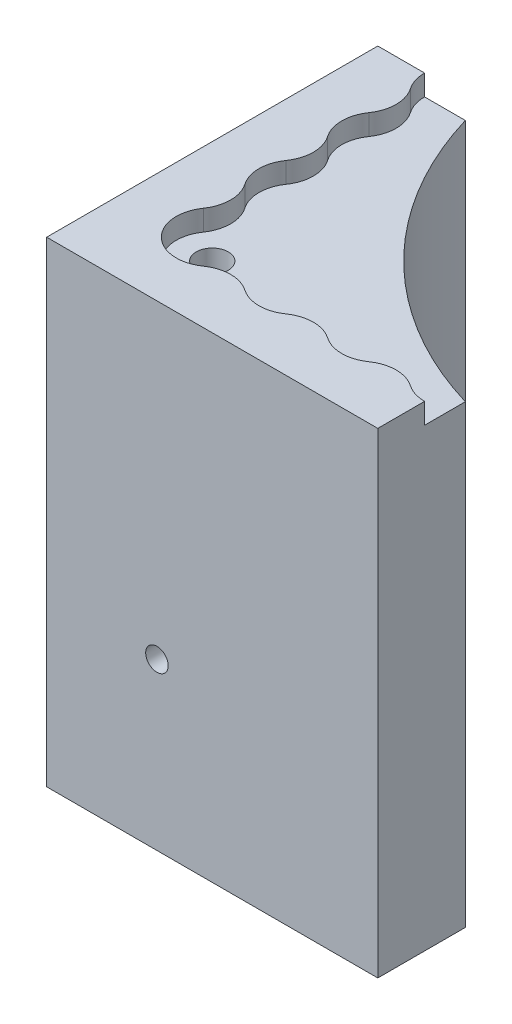
ISO-10303-21;
HEADER;
FILE_DESCRIPTION(('STEP AP214'),'2;1');
FILE_NAME('part.step','',(''),(''),'','','');
FILE_SCHEMA(('AUTOMOTIVE_DESIGN { 1 0 10303 214 1 1 1 1 }'));
ENDSEC;
DATA;
#1=APPLICATION_CONTEXT('core data for automotive mechanical design processes');
#2=APPLICATION_PROTOCOL_DEFINITION('international standard','automotive_design',2000,#1);
#3=PRODUCT_CONTEXT('',#1,'mechanical');
#4=PRODUCT('Part','Part','',(#3));
#5=PRODUCT_RELATED_PRODUCT_CATEGORY('part','',(#4));
#6=PRODUCT_DEFINITION_FORMATION('','',#4);
#7=PRODUCT_DEFINITION_CONTEXT('part definition',#1,'design');
#8=PRODUCT_DEFINITION('design','',#6,#7);
#9=PRODUCT_DEFINITION_SHAPE('','',#8);
#10=(LENGTH_UNIT() NAMED_UNIT(*) SI_UNIT(.MILLI.,.METRE.));
#11=(NAMED_UNIT(*) PLANE_ANGLE_UNIT() SI_UNIT($,.RADIAN.));
#12=(NAMED_UNIT(*) SI_UNIT($,.STERADIAN.) SOLID_ANGLE_UNIT());
#13=UNCERTAINTY_MEASURE_WITH_UNIT(LENGTH_MEASURE(1.E-05),#10,'distance_accuracy_value','');
#14=(GEOMETRIC_REPRESENTATION_CONTEXT(3) GLOBAL_UNCERTAINTY_ASSIGNED_CONTEXT((#13)) GLOBAL_UNIT_ASSIGNED_CONTEXT((#10,
#11,#12)) REPRESENTATION_CONTEXT('',''));
#15=CARTESIAN_POINT('',(0.,0.,0.));
#16=DIRECTION('',(0.,0.,1.));
#17=DIRECTION('',(1.,0.,0.));
#18=AXIS2_PLACEMENT_3D('',#15,#16,#17);
#19=CARTESIAN_POINT('',(0.,73.025,0.));
#20=DIRECTION('',(1.,0.,0.));
#21=DIRECTION('',(0.,0.,-1.));
#22=AXIS2_PLACEMENT_3D('',#19,#20,#21);
#23=PLANE('',#22);
#24=CARTESIAN_POINT('',(0.,25.3999999999999,-18.7319999999885));
#25=DIRECTION('',(-1.,0.,0.));
#26=DIRECTION('',(0.,0.,1.));
#27=AXIS2_PLACEMENT_3D('',#24,#25,#26);
#28=CIRCLE('',#27,1.7272);
#29=CARTESIAN_POINT('',(0.,25.3999999999999,-17.0047999999885));
#30=VERTEX_POINT('',#29);
#31=EDGE_CURVE('E223',#30,#30,#28,.T.);
#32=ORIENTED_EDGE('',*,*,#31,.F.);
#33=EDGE_LOOP('',(#32));
#34=FACE_BOUND('',#33,.T.);
#35=DIRECTION('',(0.,0.,1.));
#36=VECTOR('',#35,1.);
#37=CARTESIAN_POINT('',(0.,0.,0.));
#38=LINE('',#37,#36);
#39=CARTESIAN_POINT('',(0.,0.,-50.8));
#40=VERTEX_POINT('',#39);
#41=CARTESIAN_POINT('',(0.,0.,0.));
#42=VERTEX_POINT('',#41);
#43=EDGE_CURVE('E389',#40,#42,#38,.T.);
#44=ORIENTED_EDGE('',*,*,#43,.T.);
#45=DIRECTION('',(0.,-1.,0.));
#46=VECTOR('',#45,1.);
#47=CARTESIAN_POINT('',(0.,73.025,0.));
#48=LINE('',#47,#46);
#49=CARTESIAN_POINT('',(0.,73.025,0.));
#50=VERTEX_POINT('',#49);
#51=EDGE_CURVE('E424',#50,#42,#48,.T.);
#52=ORIENTED_EDGE('',*,*,#51,.F.);
#53=DIRECTION('',(0.,0.,1.));
#54=VECTOR('',#53,1.);
#55=CARTESIAN_POINT('',(0.,73.025,0.));
#56=LINE('',#55,#54);
#57=CARTESIAN_POINT('',(0.,73.025,-50.8));
#58=VERTEX_POINT('',#57);
#59=EDGE_CURVE('E390',#58,#50,#56,.T.);
#60=ORIENTED_EDGE('',*,*,#59,.F.);
#61=DIRECTION('',(0.,-1.,0.));
#62=VECTOR('',#61,1.);
#63=CARTESIAN_POINT('',(0.,73.025,-50.8));
#64=LINE('',#63,#62);
#65=EDGE_CURVE('E404',#58,#40,#64,.T.);
#66=ORIENTED_EDGE('',*,*,#65,.T.);
#67=EDGE_LOOP('',(#44,#52,#60,#66));
#68=FACE_BOUND('',#67,.T.);
#69=ADVANCED_FACE('F47',(#34,#68),#23,.F.);
#70=CARTESIAN_POINT('',(0.,73.025,0.));
#71=DIRECTION('',(0.,0.,-1.));
#72=DIRECTION('',(-1.,0.,0.));
#73=AXIS2_PLACEMENT_3D('',#70,#71,#72);
#74=PLANE('',#73);
#75=CARTESIAN_POINT('',(16.9179999999882,25.3999999999999,-1.10986530529513E-13));
#76=DIRECTION('',(0.,0.,1.));
#77=DIRECTION('',(1.,0.,0.));
#78=AXIS2_PLACEMENT_3D('',#75,#76,#77);
#79=CIRCLE('',#78,1.7272);
#80=CARTESIAN_POINT('',(18.6451999999882,25.3999999999999,-1.10986530529513E-13));
#81=VERTEX_POINT('',#80);
#82=EDGE_CURVE('E222',#81,#81,#79,.T.);
#83=ORIENTED_EDGE('',*,*,#82,.F.);
#84=EDGE_LOOP('',(#83));
#85=FACE_BOUND('',#84,.T.);
#86=DIRECTION('',(1.,0.,0.));
#87=VECTOR('',#86,1.);
#88=CARTESIAN_POINT('',(0.,0.,0.));
#89=LINE('',#88,#87);
#90=CARTESIAN_POINT('',(50.8,0.,0.));
#91=VERTEX_POINT('',#90);
#92=EDGE_CURVE('E408',#42,#91,#89,.T.);
#93=ORIENTED_EDGE('',*,*,#92,.T.);
#94=DIRECTION('',(0.,-1.,0.));
#95=VECTOR('',#94,1.);
#96=CARTESIAN_POINT('',(50.8,73.025,0.));
#97=LINE('',#96,#95);
#98=CARTESIAN_POINT('',(50.8,73.025,0.));
#99=VERTEX_POINT('',#98);
#100=EDGE_CURVE('E420',#99,#91,#97,.T.);
#101=ORIENTED_EDGE('',*,*,#100,.F.);
#102=DIRECTION('',(1.,0.,0.));
#103=VECTOR('',#102,1.);
#104=CARTESIAN_POINT('',(0.,73.025,0.));
#105=LINE('',#104,#103);
#106=EDGE_CURVE('E394',#50,#99,#105,.T.);
#107=ORIENTED_EDGE('',*,*,#106,.F.);
#108=ORIENTED_EDGE('',*,*,#51,.T.);
#109=EDGE_LOOP('',(#93,#101,#107,#108));
#110=FACE_BOUND('',#109,.T.);
#111=ADVANCED_FACE('F496',(#85,#110),#74,.F.);
#112=CARTESIAN_POINT('',(50.8,73.025,0.));
#113=DIRECTION('',(-1.,0.,0.));
#114=DIRECTION('',(0.,0.,1.));
#115=AXIS2_PLACEMENT_3D('',#112,#113,#114);
#116=PLANE('',#115);
#117=DIRECTION('',(0.,0.,-1.));
#118=VECTOR('',#117,1.);
#119=CARTESIAN_POINT('',(50.8,0.,0.));
#120=LINE('',#119,#118);
#121=CARTESIAN_POINT('',(50.8,0.,-13.4286312857863));
#122=VERTEX_POINT('',#121);
#123=EDGE_CURVE('E411',#91,#122,#120,.T.);
#124=ORIENTED_EDGE('',*,*,#123,.T.);
#125=DIRECTION('',(0.,1.,0.));
#126=VECTOR('',#125,1.);
#127=CARTESIAN_POINT('',(50.8,0.,-13.4286312857863));
#128=LINE('',#127,#126);
#129=CARTESIAN_POINT('',(50.8,69.85,-13.4286312857863));
#130=VERTEX_POINT('',#129);
#131=EDGE_CURVE('E246',#122,#130,#128,.T.);
#132=ORIENTED_EDGE('',*,*,#131,.T.);
#133=DIRECTION('',(0.,0.,-1.));
#134=VECTOR('',#133,1.);
#135=CARTESIAN_POINT('',(50.8,69.85,0.));
#136=LINE('',#135,#134);
#137=CARTESIAN_POINT('',(50.8,69.85,-7.17550000000003));
#138=VERTEX_POINT('',#137);
#139=EDGE_CURVE('E386',#138,#130,#136,.T.);
#140=ORIENTED_EDGE('',*,*,#139,.F.);
#141=DIRECTION('',(0.,1.,0.));
#142=VECTOR('',#141,1.);
#143=CARTESIAN_POINT('',(50.8,69.85,-7.17550000000003));
#144=LINE('',#143,#142);
#145=CARTESIAN_POINT('',(50.8,73.025,-7.17550000000003));
#146=VERTEX_POINT('',#145);
#147=EDGE_CURVE('E383',#138,#146,#144,.T.);
#148=ORIENTED_EDGE('',*,*,#147,.T.);
#149=DIRECTION('',(0.,0.,-1.));
#150=VECTOR('',#149,1.);
#151=CARTESIAN_POINT('',(50.8,73.025,0.));
#152=LINE('',#151,#150);
#153=EDGE_CURVE('E398',#99,#146,#152,.T.);
#154=ORIENTED_EDGE('',*,*,#153,.F.);
#155=ORIENTED_EDGE('',*,*,#100,.T.);
#156=EDGE_LOOP('',(#124,#132,#140,#148,#154,#155));
#157=FACE_BOUND('',#156,.T.);
#158=ADVANCED_FACE('F493',(#157),#116,.F.);
#159=CARTESIAN_POINT('',(0.,73.025,-50.8));
#160=DIRECTION('',(0.,0.,1.));
#161=DIRECTION('',(1.,0.,0.));
#162=AXIS2_PLACEMENT_3D('',#159,#160,#161);
#163=PLANE('',#162);
#164=DIRECTION('',(-1.,0.,0.));
#165=VECTOR('',#164,1.);
#166=CARTESIAN_POINT('',(0.,69.85,-50.8));
#167=LINE('',#166,#165);
#168=CARTESIAN_POINT('',(13.4286312857863,69.85,-50.8));
#169=VERTEX_POINT('',#168);
#170=CARTESIAN_POINT('',(7.17550000000002,69.85,-50.8));
#171=VERTEX_POINT('',#170);
#172=EDGE_CURVE('E55',#169,#171,#167,.T.);
#173=ORIENTED_EDGE('',*,*,#172,.F.);
#174=DIRECTION('',(0.,1.,0.));
#175=VECTOR('',#174,1.);
#176=CARTESIAN_POINT('',(13.4286312857863,0.,-50.8));
#177=LINE('',#176,#175);
#178=CARTESIAN_POINT('',(13.4286312857863,0.,-50.8));
#179=VERTEX_POINT('',#178);
#180=EDGE_CURVE('E64',#169,#179,#177,.F.);
#181=ORIENTED_EDGE('',*,*,#180,.T.);
#182=DIRECTION('',(-1.,0.,0.));
#183=VECTOR('',#182,1.);
#184=CARTESIAN_POINT('',(0.,0.,-50.8));
#185=LINE('',#184,#183);
#186=EDGE_CURVE('E395',#179,#40,#185,.T.);
#187=ORIENTED_EDGE('',*,*,#186,.T.);
#188=ORIENTED_EDGE('',*,*,#65,.F.);
#189=DIRECTION('',(-1.,0.,0.));
#190=VECTOR('',#189,1.);
#191=CARTESIAN_POINT('',(0.,73.025,-50.8));
#192=LINE('',#191,#190);
#193=CARTESIAN_POINT('',(7.17550000000002,73.025,-50.8));
#194=VERTEX_POINT('',#193);
#195=EDGE_CURVE('E401',#194,#58,#192,.T.);
#196=ORIENTED_EDGE('',*,*,#195,.F.);
#197=DIRECTION('',(0.,1.,0.));
#198=VECTOR('',#197,1.);
#199=CARTESIAN_POINT('',(7.17550000000002,69.85,-50.8));
#200=LINE('',#199,#198);
#201=EDGE_CURVE('E75',#194,#171,#200,.F.);
#202=ORIENTED_EDGE('',*,*,#201,.T.);
#203=EDGE_LOOP('',(#173,#181,#187,#188,#196,#202));
#204=FACE_BOUND('',#203,.T.);
#205=ADVANCED_FACE('F437',(#204),#163,.F.);
#206=CARTESIAN_POINT('',(0.,73.025,0.));
#207=DIRECTION('',(0.,-1.,0.));
#208=DIRECTION('',(0.,0.,-1.));
#209=AXIS2_PLACEMENT_3D('',#206,#207,#208);
#210=PLANE('',#209);
#211=ORIENTED_EDGE('',*,*,#153,.T.);
#212=CARTESIAN_POINT('',(50.8,73.025,-12.7));
#213=DIRECTION('',(0.,1.,0.));
#214=DIRECTION('',(0.,0.,1.));
#215=AXIS2_PLACEMENT_3D('',#212,#213,#214);
#216=CIRCLE('',#215,5.5245);
#217=CARTESIAN_POINT('',(47.6431428571429,73.025,-8.16630909417155));
#218=VERTEX_POINT('',#217);
#219=EDGE_CURVE('E255',#218,#146,#216,.T.);
#220=ORIENTED_EDGE('',*,*,#219,.F.);
#221=CARTESIAN_POINT('',(44.45,73.025,-3.58050679862091));
#222=DIRECTION('',(0.,-1.,0.));
#223=DIRECTION('',(0.,0.,1.));
#224=AXIS2_PLACEMENT_3D('',#221,#222,#223);
#225=CIRCLE('',#224,5.588);
#226=CARTESIAN_POINT('',(41.2568571428572,73.025,-8.16630909417154));
#227=VERTEX_POINT('',#226);
#228=EDGE_CURVE('E342',#227,#218,#225,.T.);
#229=ORIENTED_EDGE('',*,*,#228,.F.);
#230=CARTESIAN_POINT('',(38.1,73.025,-12.7));
#231=DIRECTION('',(0.,1.,0.));
#232=DIRECTION('',(0.,0.,1.));
#233=AXIS2_PLACEMENT_3D('',#230,#231,#232);
#234=CIRCLE('',#233,5.5245);
#235=CARTESIAN_POINT('',(34.9431428571429,73.025,-8.16630909417153));
#236=VERTEX_POINT('',#235);
#237=EDGE_CURVE('E338',#236,#227,#234,.T.);
#238=ORIENTED_EDGE('',*,*,#237,.F.);
#239=CARTESIAN_POINT('',(31.75,73.025,-3.58050679862088));
#240=DIRECTION('',(0.,-1.,0.));
#241=DIRECTION('',(0.,0.,1.));
#242=AXIS2_PLACEMENT_3D('',#239,#240,#241);
#243=CIRCLE('',#242,5.588);
#244=CARTESIAN_POINT('',(28.5568571428572,73.025,-8.16630909417152));
#245=VERTEX_POINT('',#244);
#246=EDGE_CURVE('E334',#245,#236,#243,.T.);
#247=ORIENTED_EDGE('',*,*,#246,.F.);
#248=CARTESIAN_POINT('',(25.4,73.025,-12.7));
#249=DIRECTION('',(0.,1.,0.));
#250=DIRECTION('',(0.,0.,1.));
#251=AXIS2_PLACEMENT_3D('',#248,#249,#250);
#252=CIRCLE('',#251,5.5245);
#253=CARTESIAN_POINT('',(22.2431428571429,73.025,-8.16630909417153));
#254=VERTEX_POINT('',#253);
#255=EDGE_CURVE('E330',#254,#245,#252,.T.);
#256=ORIENTED_EDGE('',*,*,#255,.F.);
#257=CARTESIAN_POINT('',(19.05,73.025,-3.58050679862087));
#258=DIRECTION('',(0.,-1.,0.));
#259=DIRECTION('',(0.,0.,1.));
#260=AXIS2_PLACEMENT_3D('',#257,#258,#259);
#261=CIRCLE('',#260,5.588);
#262=CARTESIAN_POINT('',(15.8568571428572,73.025,-8.16630909417152));
#263=VERTEX_POINT('',#262);
#264=EDGE_CURVE('E326',#263,#254,#261,.T.);
#265=ORIENTED_EDGE('',*,*,#264,.F.);
#266=CARTESIAN_POINT('',(12.7,73.025,-12.7));
#267=DIRECTION('',(0.,1.,0.));
#268=DIRECTION('',(0.,0.,1.));
#269=AXIS2_PLACEMENT_3D('',#266,#267,#268);
#270=CIRCLE('',#269,5.5245);
#271=CARTESIAN_POINT('',(8.16630909417153,73.025,-15.8568571428571));
#272=VERTEX_POINT('',#271);
#273=EDGE_CURVE('E322',#272,#263,#270,.T.);
#274=ORIENTED_EDGE('',*,*,#273,.F.);
#275=CARTESIAN_POINT('',(3.58050679862089,73.025,-19.05));
#276=DIRECTION('',(0.,-1.,0.));
#277=DIRECTION('',(0.,0.,1.));
#278=AXIS2_PLACEMENT_3D('',#275,#276,#277);
#279=CIRCLE('',#278,5.588);
#280=CARTESIAN_POINT('',(8.16630909417154,73.025,-22.2431428571428));
#281=VERTEX_POINT('',#280);
#282=EDGE_CURVE('E318',#281,#272,#279,.T.);
#283=ORIENTED_EDGE('',*,*,#282,.F.);
#284=CARTESIAN_POINT('',(12.7,73.025,-25.4));
#285=DIRECTION('',(0.,1.,0.));
#286=DIRECTION('',(0.,0.,1.));
#287=AXIS2_PLACEMENT_3D('',#284,#285,#286);
#288=CIRCLE('',#287,5.5245);
#289=CARTESIAN_POINT('',(8.16630909417154,73.025,-28.5568571428571));
#290=VERTEX_POINT('',#289);
#291=EDGE_CURVE('E314',#290,#281,#288,.T.);
#292=ORIENTED_EDGE('',*,*,#291,.F.);
#293=CARTESIAN_POINT('',(3.5805067986209,73.025,-31.75));
#294=DIRECTION('',(0.,-1.,0.));
#295=DIRECTION('',(0.,0.,1.));
#296=AXIS2_PLACEMENT_3D('',#293,#294,#295);
#297=CIRCLE('',#296,5.588);
#298=CARTESIAN_POINT('',(8.16630909417155,73.025,-34.9431428571428));
#299=VERTEX_POINT('',#298);
#300=EDGE_CURVE('E310',#299,#290,#297,.T.);
#301=ORIENTED_EDGE('',*,*,#300,.F.);
#302=CARTESIAN_POINT('',(12.7,73.025,-38.1));
#303=DIRECTION('',(0.,1.,0.));
#304=DIRECTION('',(0.,0.,1.));
#305=AXIS2_PLACEMENT_3D('',#302,#303,#304);
#306=CIRCLE('',#305,5.5245);
#307=CARTESIAN_POINT('',(8.16630909417156,73.025,-41.2568571428571));
#308=VERTEX_POINT('',#307);
#309=EDGE_CURVE('E306',#308,#299,#306,.T.);
#310=ORIENTED_EDGE('',*,*,#309,.F.);
#311=CARTESIAN_POINT('',(3.58050679862091,73.025,-44.45));
#312=DIRECTION('',(0.,-1.,0.));
#313=DIRECTION('',(0.,0.,1.));
#314=AXIS2_PLACEMENT_3D('',#311,#312,#313);
#315=CIRCLE('',#314,5.588);
#316=CARTESIAN_POINT('',(8.16630909417155,73.025,-47.6431428571429));
#317=VERTEX_POINT('',#316);
#318=EDGE_CURVE('E250',#317,#308,#315,.T.);
#319=ORIENTED_EDGE('',*,*,#318,.F.);
#320=CARTESIAN_POINT('',(12.7,73.025,-50.8));
#321=DIRECTION('',(0.,-1.,0.));
#322=DIRECTION('',(0.,0.,-1.));
#323=AXIS2_PLACEMENT_3D('',#320,#321,#322);
#324=CIRCLE('',#323,5.5245);
#325=EDGE_CURVE('E427',#317,#194,#324,.T.);
#326=ORIENTED_EDGE('',*,*,#325,.T.);
#327=ORIENTED_EDGE('',*,*,#195,.T.);
#328=ORIENTED_EDGE('',*,*,#59,.T.);
#329=ORIENTED_EDGE('',*,*,#106,.T.);
#330=EDGE_LOOP('',(#211,#220,#229,#238,#247,#256,#265,#274,#283,#292,#301,#310,#319,#326,#327,
#328,#329));
#331=FACE_BOUND('',#330,.T.);
#332=ADVANCED_FACE('F441',(#331),#210,.F.);
#333=CARTESIAN_POINT('',(0.,0.,0.));
#334=DIRECTION('',(0.,-1.,0.));
#335=DIRECTION('',(0.,0.,-1.));
#336=AXIS2_PLACEMENT_3D('',#333,#334,#335);
#337=PLANE('',#336);
#338=CARTESIAN_POINT('',(12.7,0.,-12.7));
#339=DIRECTION('',(0.,1.,0.));
#340=DIRECTION('',(0.,0.,1.));
#341=AXIS2_PLACEMENT_3D('',#338,#339,#340);
#342=CIRCLE('',#341,2.45744999999999);
#343=CARTESIAN_POINT('',(12.7,0.,-10.24255));
#344=VERTEX_POINT('',#343);
#345=EDGE_CURVE('E233',#344,#344,#342,.T.);
#346=ORIENTED_EDGE('',*,*,#345,.T.);
#347=EDGE_LOOP('',(#346));
#348=FACE_BOUND('',#347,.T.);
#349=CARTESIAN_POINT('',(66.675,0.,-66.675));
#350=DIRECTION('',(0.,1.,0.));
#351=DIRECTION('',(0.,0.,1.));
#352=AXIS2_PLACEMENT_3D('',#349,#350,#351);
#353=CIRCLE('',#352,55.5625);
#354=EDGE_CURVE('E240',#179,#122,#353,.T.);
#355=ORIENTED_EDGE('',*,*,#354,.T.);
#356=ORIENTED_EDGE('',*,*,#123,.F.);
#357=ORIENTED_EDGE('',*,*,#92,.F.);
#358=ORIENTED_EDGE('',*,*,#43,.F.);
#359=ORIENTED_EDGE('',*,*,#186,.F.);
#360=EDGE_LOOP('',(#355,#356,#357,#358,#359));
#361=FACE_BOUND('',#360,.T.);
#362=ADVANCED_FACE('F499',(#348,#361),#337,.T.);
#363=CARTESIAN_POINT('',(124.51538150761,69.85,-124.51538150761));
#364=DIRECTION('',(0.,1.,0.));
#365=DIRECTION('',(0.,0.,1.));
#366=AXIS2_PLACEMENT_3D('',#363,#364,#365);
#367=PLANE('',#366);
#368=CARTESIAN_POINT('',(12.7,69.85,-12.7));
#369=DIRECTION('',(0.,1.,0.));
#370=DIRECTION('',(0.,0.,1.));
#371=AXIS2_PLACEMENT_3D('',#368,#369,#370);
#372=CIRCLE('',#371,2.45744999999999);
#373=CARTESIAN_POINT('',(12.7,69.85,-10.24255));
#374=VERTEX_POINT('',#373);
#375=EDGE_CURVE('E730',#374,#374,#372,.T.);
#376=ORIENTED_EDGE('',*,*,#375,.F.);
#377=EDGE_LOOP('',(#376));
#378=FACE_BOUND('',#377,.T.);
#379=CARTESIAN_POINT('',(66.675,69.85,-66.675));
#380=DIRECTION('',(0.,1.,0.));
#381=DIRECTION('',(0.,0.,1.));
#382=AXIS2_PLACEMENT_3D('',#379,#380,#381);
#383=CIRCLE('',#382,55.5625);
#384=EDGE_CURVE('E11',#169,#130,#383,.T.);
#385=ORIENTED_EDGE('',*,*,#384,.F.);
#386=ORIENTED_EDGE('',*,*,#172,.T.);
#387=CARTESIAN_POINT('',(12.7,69.85,-50.8));
#388=DIRECTION('',(0.,1.,0.));
#389=DIRECTION('',(0.,0.,1.));
#390=AXIS2_PLACEMENT_3D('',#387,#388,#389);
#391=CIRCLE('',#390,5.5245);
#392=CARTESIAN_POINT('',(8.16630909417155,69.85,-47.6431428571429));
#393=VERTEX_POINT('',#392);
#394=EDGE_CURVE('E251',#171,#393,#391,.T.);
#395=ORIENTED_EDGE('',*,*,#394,.T.);
#396=CARTESIAN_POINT('',(3.58050679862091,69.85,-44.45));
#397=DIRECTION('',(0.,-1.,0.));
#398=DIRECTION('',(0.,0.,1.));
#399=AXIS2_PLACEMENT_3D('',#396,#397,#398);
#400=CIRCLE('',#399,5.588);
#401=CARTESIAN_POINT('',(8.16630909417156,69.85,-41.2568571428571));
#402=VERTEX_POINT('',#401);
#403=EDGE_CURVE('E254',#393,#402,#400,.T.);
#404=ORIENTED_EDGE('',*,*,#403,.T.);
#405=CARTESIAN_POINT('',(12.7,69.85,-38.1));
#406=DIRECTION('',(0.,1.,0.));
#407=DIRECTION('',(0.,0.,1.));
#408=AXIS2_PLACEMENT_3D('',#405,#406,#407);
#409=CIRCLE('',#408,5.5245);
#410=CARTESIAN_POINT('',(8.16630909417155,69.85,-34.9431428571428));
#411=VERTEX_POINT('',#410);
#412=EDGE_CURVE('E259',#402,#411,#409,.T.);
#413=ORIENTED_EDGE('',*,*,#412,.T.);
#414=CARTESIAN_POINT('',(3.5805067986209,69.85,-31.75));
#415=DIRECTION('',(0.,-1.,0.));
#416=DIRECTION('',(0.,0.,1.));
#417=AXIS2_PLACEMENT_3D('',#414,#415,#416);
#418=CIRCLE('',#417,5.588);
#419=CARTESIAN_POINT('',(8.16630909417154,69.85,-28.5568571428571));
#420=VERTEX_POINT('',#419);
#421=EDGE_CURVE('E263',#411,#420,#418,.T.);
#422=ORIENTED_EDGE('',*,*,#421,.T.);
#423=CARTESIAN_POINT('',(12.7,69.85,-25.4));
#424=DIRECTION('',(0.,1.,0.));
#425=DIRECTION('',(0.,0.,1.));
#426=AXIS2_PLACEMENT_3D('',#423,#424,#425);
#427=CIRCLE('',#426,5.5245);
#428=CARTESIAN_POINT('',(8.16630909417154,69.85,-22.2431428571428));
#429=VERTEX_POINT('',#428);
#430=EDGE_CURVE('E267',#420,#429,#427,.T.);
#431=ORIENTED_EDGE('',*,*,#430,.T.);
#432=CARTESIAN_POINT('',(3.58050679862089,69.85,-19.05));
#433=DIRECTION('',(0.,-1.,0.));
#434=DIRECTION('',(0.,0.,1.));
#435=AXIS2_PLACEMENT_3D('',#432,#433,#434);
#436=CIRCLE('',#435,5.588);
#437=CARTESIAN_POINT('',(8.16630909417153,69.85,-15.8568571428571));
#438=VERTEX_POINT('',#437);
#439=EDGE_CURVE('E271',#429,#438,#436,.T.);
#440=ORIENTED_EDGE('',*,*,#439,.T.);
#441=CARTESIAN_POINT('',(12.7,69.85,-12.7));
#442=DIRECTION('',(0.,1.,0.));
#443=DIRECTION('',(0.,0.,1.));
#444=AXIS2_PLACEMENT_3D('',#441,#442,#443);
#445=CIRCLE('',#444,5.5245);
#446=CARTESIAN_POINT('',(15.8568571428572,69.85,-8.16630909417152));
#447=VERTEX_POINT('',#446);
#448=EDGE_CURVE('E275',#438,#447,#445,.T.);
#449=ORIENTED_EDGE('',*,*,#448,.T.);
#450=CARTESIAN_POINT('',(19.05,69.85,-3.58050679862087));
#451=DIRECTION('',(0.,-1.,0.));
#452=DIRECTION('',(0.,0.,1.));
#453=AXIS2_PLACEMENT_3D('',#450,#451,#452);
#454=CIRCLE('',#453,5.588);
#455=CARTESIAN_POINT('',(22.2431428571429,69.85,-8.16630909417153));
#456=VERTEX_POINT('',#455);
#457=EDGE_CURVE('E279',#447,#456,#454,.T.);
#458=ORIENTED_EDGE('',*,*,#457,.T.);
#459=CARTESIAN_POINT('',(25.4,69.85,-12.7));
#460=DIRECTION('',(0.,1.,0.));
#461=DIRECTION('',(0.,0.,1.));
#462=AXIS2_PLACEMENT_3D('',#459,#460,#461);
#463=CIRCLE('',#462,5.5245);
#464=CARTESIAN_POINT('',(28.5568571428572,69.85,-8.16630909417152));
#465=VERTEX_POINT('',#464);
#466=EDGE_CURVE('E283',#456,#465,#463,.T.);
#467=ORIENTED_EDGE('',*,*,#466,.T.);
#468=CARTESIAN_POINT('',(31.75,69.85,-3.58050679862088));
#469=DIRECTION('',(0.,-1.,0.));
#470=DIRECTION('',(0.,0.,1.));
#471=AXIS2_PLACEMENT_3D('',#468,#469,#470);
#472=CIRCLE('',#471,5.588);
#473=CARTESIAN_POINT('',(34.9431428571429,69.85,-8.16630909417153));
#474=VERTEX_POINT('',#473);
#475=EDGE_CURVE('E287',#465,#474,#472,.T.);
#476=ORIENTED_EDGE('',*,*,#475,.T.);
#477=CARTESIAN_POINT('',(38.1,69.85,-12.7));
#478=DIRECTION('',(0.,1.,0.));
#479=DIRECTION('',(0.,0.,1.));
#480=AXIS2_PLACEMENT_3D('',#477,#478,#479);
#481=CIRCLE('',#480,5.5245);
#482=CARTESIAN_POINT('',(41.2568571428572,69.85,-8.16630909417154));
#483=VERTEX_POINT('',#482);
#484=EDGE_CURVE('E291',#474,#483,#481,.T.);
#485=ORIENTED_EDGE('',*,*,#484,.T.);
#486=CARTESIAN_POINT('',(44.45,69.85,-3.58050679862091));
#487=DIRECTION('',(0.,-1.,0.));
#488=DIRECTION('',(0.,0.,1.));
#489=AXIS2_PLACEMENT_3D('',#486,#487,#488);
#490=CIRCLE('',#489,5.588);
#491=CARTESIAN_POINT('',(47.6431428571429,69.85,-8.16630909417155));
#492=VERTEX_POINT('',#491);
#493=EDGE_CURVE('E295',#483,#492,#490,.T.);
#494=ORIENTED_EDGE('',*,*,#493,.T.);
#495=CARTESIAN_POINT('',(50.8,69.85,-12.7));
#496=DIRECTION('',(0.,1.,0.));
#497=DIRECTION('',(0.,0.,1.));
#498=AXIS2_PLACEMENT_3D('',#495,#496,#497);
#499=CIRCLE('',#498,5.5245);
#500=EDGE_CURVE('E299',#492,#138,#499,.T.);
#501=ORIENTED_EDGE('',*,*,#500,.T.);
#502=ORIENTED_EDGE('',*,*,#139,.T.);
#503=EDGE_LOOP('',(#385,#386,#395,#404,#413,#422,#431,#440,#449,#458,#467,#476,#485,#494,#501,#502));
#504=FACE_BOUND('',#503,.T.);
#505=ADVANCED_FACE('F431',(#378,#504),#367,.T.);
#506=CARTESIAN_POINT('',(50.8,69.85,-12.7));
#507=DIRECTION('',(0.,1.,0.));
#508=DIRECTION('',(0.,0.,1.));
#509=AXIS2_PLACEMENT_3D('',#506,#507,#508);
#510=CYLINDRICAL_SURFACE('',#509,5.5245);
#511=ORIENTED_EDGE('',*,*,#500,.F.);
#512=DIRECTION('',(0.,1.,0.));
#513=VECTOR('',#512,1.);
#514=CARTESIAN_POINT('',(47.6431428571429,69.85,-8.16630909417155));
#515=LINE('',#514,#513);
#516=EDGE_CURVE('E347',#492,#218,#515,.T.);
#517=ORIENTED_EDGE('',*,*,#516,.T.);
#518=ORIENTED_EDGE('',*,*,#219,.T.);
#519=ORIENTED_EDGE('',*,*,#147,.F.);
#520=EDGE_LOOP('',(#511,#517,#518,#519));
#521=FACE_BOUND('',#520,.T.);
#522=ADVANCED_FACE('F490',(#521),#510,.F.);
#523=CARTESIAN_POINT('',(12.7,69.85,-50.8));
#524=DIRECTION('',(0.,1.,0.));
#525=DIRECTION('',(0.,0.,1.));
#526=AXIS2_PLACEMENT_3D('',#523,#524,#525);
#527=CYLINDRICAL_SURFACE('',#526,5.5245);
#528=ORIENTED_EDGE('',*,*,#325,.F.);
#529=DIRECTION('',(0.,1.,0.));
#530=VECTOR('',#529,1.);
#531=CARTESIAN_POINT('',(8.16630909417155,69.85,-47.6431428571429));
#532=LINE('',#531,#530);
#533=EDGE_CURVE('E302',#393,#317,#532,.T.);
#534=ORIENTED_EDGE('',*,*,#533,.F.);
#535=ORIENTED_EDGE('',*,*,#394,.F.);
#536=ORIENTED_EDGE('',*,*,#201,.F.);
#537=EDGE_LOOP('',(#528,#534,#535,#536));
#538=FACE_BOUND('',#537,.T.);
#539=ADVANCED_FACE('F434',(#538),#527,.F.);
#540=CARTESIAN_POINT('',(44.45,69.85,-3.58050679862091));
#541=DIRECTION('',(0.,1.,0.));
#542=DIRECTION('',(0.,0.,1.));
#543=AXIS2_PLACEMENT_3D('',#540,#541,#542);
#544=CYLINDRICAL_SURFACE('',#543,5.588);
#545=ORIENTED_EDGE('',*,*,#228,.T.);
#546=ORIENTED_EDGE('',*,*,#516,.F.);
#547=ORIENTED_EDGE('',*,*,#493,.F.);
#548=DIRECTION('',(0.,1.,0.));
#549=VECTOR('',#548,1.);
#550=CARTESIAN_POINT('',(41.2568571428572,69.85,-8.16630909417154));
#551=LINE('',#550,#549);
#552=EDGE_CURVE('E349',#483,#227,#551,.T.);
#553=ORIENTED_EDGE('',*,*,#552,.T.);
#554=EDGE_LOOP('',(#545,#546,#547,#553));
#555=FACE_BOUND('',#554,.T.);
#556=ADVANCED_FACE('F486',(#555),#544,.T.);
#557=CARTESIAN_POINT('',(38.1,69.85,-12.7));
#558=DIRECTION('',(0.,1.,0.));
#559=DIRECTION('',(0.,0.,1.));
#560=AXIS2_PLACEMENT_3D('',#557,#558,#559);
#561=CYLINDRICAL_SURFACE('',#560,5.5245);
#562=ORIENTED_EDGE('',*,*,#237,.T.);
#563=ORIENTED_EDGE('',*,*,#552,.F.);
#564=ORIENTED_EDGE('',*,*,#484,.F.);
#565=DIRECTION('',(0.,1.,0.));
#566=VECTOR('',#565,1.);
#567=CARTESIAN_POINT('',(34.9431428571429,69.85,-8.16630909417153));
#568=LINE('',#567,#566);
#569=EDGE_CURVE('E352',#474,#236,#568,.T.);
#570=ORIENTED_EDGE('',*,*,#569,.T.);
#571=EDGE_LOOP('',(#562,#563,#564,#570));
#572=FACE_BOUND('',#571,.T.);
#573=ADVANCED_FACE('F481',(#572),#561,.F.);
#574=CARTESIAN_POINT('',(31.75,69.85,-3.58050679862088));
#575=DIRECTION('',(0.,1.,0.));
#576=DIRECTION('',(0.,0.,1.));
#577=AXIS2_PLACEMENT_3D('',#574,#575,#576);
#578=CYLINDRICAL_SURFACE('',#577,5.588);
#579=ORIENTED_EDGE('',*,*,#246,.T.);
#580=ORIENTED_EDGE('',*,*,#569,.F.);
#581=ORIENTED_EDGE('',*,*,#475,.F.);
#582=DIRECTION('',(0.,1.,0.));
#583=VECTOR('',#582,1.);
#584=CARTESIAN_POINT('',(28.5568571428572,69.85,-8.16630909417152));
#585=LINE('',#584,#583);
#586=EDGE_CURVE('E355',#465,#245,#585,.T.);
#587=ORIENTED_EDGE('',*,*,#586,.T.);
#588=EDGE_LOOP('',(#579,#580,#581,#587));
#589=FACE_BOUND('',#588,.T.);
#590=ADVANCED_FACE('F477',(#589),#578,.T.);
#591=CARTESIAN_POINT('',(25.4,69.85,-12.7));
#592=DIRECTION('',(0.,1.,0.));
#593=DIRECTION('',(0.,0.,1.));
#594=AXIS2_PLACEMENT_3D('',#591,#592,#593);
#595=CYLINDRICAL_SURFACE('',#594,5.5245);
#596=ORIENTED_EDGE('',*,*,#255,.T.);
#597=ORIENTED_EDGE('',*,*,#586,.F.);
#598=ORIENTED_EDGE('',*,*,#466,.F.);
#599=DIRECTION('',(0.,1.,0.));
#600=VECTOR('',#599,1.);
#601=CARTESIAN_POINT('',(22.2431428571429,69.85,-8.16630909417153));
#602=LINE('',#601,#600);
#603=EDGE_CURVE('E358',#456,#254,#602,.T.);
#604=ORIENTED_EDGE('',*,*,#603,.T.);
#605=EDGE_LOOP('',(#596,#597,#598,#604));
#606=FACE_BOUND('',#605,.T.);
#607=ADVANCED_FACE('F473',(#606),#595,.F.);
#608=CARTESIAN_POINT('',(19.05,69.85,-3.58050679862087));
#609=DIRECTION('',(0.,1.,0.));
#610=DIRECTION('',(0.,0.,1.));
#611=AXIS2_PLACEMENT_3D('',#608,#609,#610);
#612=CYLINDRICAL_SURFACE('',#611,5.588);
#613=ORIENTED_EDGE('',*,*,#264,.T.);
#614=ORIENTED_EDGE('',*,*,#603,.F.);
#615=ORIENTED_EDGE('',*,*,#457,.F.);
#616=DIRECTION('',(0.,1.,0.));
#617=VECTOR('',#616,1.);
#618=CARTESIAN_POINT('',(15.8568571428572,69.85,-8.16630909417152));
#619=LINE('',#618,#617);
#620=EDGE_CURVE('E360',#447,#263,#619,.T.);
#621=ORIENTED_EDGE('',*,*,#620,.T.);
#622=EDGE_LOOP('',(#613,#614,#615,#621));
#623=FACE_BOUND('',#622,.T.);
#624=ADVANCED_FACE('F469',(#623),#612,.T.);
#625=CARTESIAN_POINT('',(12.7,69.85,-12.7));
#626=DIRECTION('',(0.,1.,0.));
#627=DIRECTION('',(0.,0.,1.));
#628=AXIS2_PLACEMENT_3D('',#625,#626,#627);
#629=CYLINDRICAL_SURFACE('',#628,5.5245);
#630=ORIENTED_EDGE('',*,*,#273,.T.);
#631=ORIENTED_EDGE('',*,*,#620,.F.);
#632=ORIENTED_EDGE('',*,*,#448,.F.);
#633=DIRECTION('',(0.,1.,0.));
#634=VECTOR('',#633,1.);
#635=CARTESIAN_POINT('',(8.16630909417153,69.85,-15.8568571428571));
#636=LINE('',#635,#634);
#637=EDGE_CURVE('E363',#438,#272,#636,.T.);
#638=ORIENTED_EDGE('',*,*,#637,.T.);
#639=EDGE_LOOP('',(#630,#631,#632,#638));
#640=FACE_BOUND('',#639,.T.);
#641=ADVANCED_FACE('F465',(#640),#629,.F.);
#642=CARTESIAN_POINT('',(3.58050679862089,69.85,-19.05));
#643=DIRECTION('',(0.,1.,0.));
#644=DIRECTION('',(0.,0.,1.));
#645=AXIS2_PLACEMENT_3D('',#642,#643,#644);
#646=CYLINDRICAL_SURFACE('',#645,5.588);
#647=ORIENTED_EDGE('',*,*,#282,.T.);
#648=ORIENTED_EDGE('',*,*,#637,.F.);
#649=ORIENTED_EDGE('',*,*,#439,.F.);
#650=DIRECTION('',(0.,1.,0.));
#651=VECTOR('',#650,1.);
#652=CARTESIAN_POINT('',(8.16630909417154,69.85,-22.2431428571428));
#653=LINE('',#652,#651);
#654=EDGE_CURVE('E366',#429,#281,#653,.T.);
#655=ORIENTED_EDGE('',*,*,#654,.T.);
#656=EDGE_LOOP('',(#647,#648,#649,#655));
#657=FACE_BOUND('',#656,.T.);
#658=ADVANCED_FACE('F461',(#657),#646,.T.);
#659=CARTESIAN_POINT('',(12.7,69.85,-25.4));
#660=DIRECTION('',(0.,1.,0.));
#661=DIRECTION('',(0.,0.,1.));
#662=AXIS2_PLACEMENT_3D('',#659,#660,#661);
#663=CYLINDRICAL_SURFACE('',#662,5.5245);
#664=ORIENTED_EDGE('',*,*,#291,.T.);
#665=ORIENTED_EDGE('',*,*,#654,.F.);
#666=ORIENTED_EDGE('',*,*,#430,.F.);
#667=DIRECTION('',(0.,1.,0.));
#668=VECTOR('',#667,1.);
#669=CARTESIAN_POINT('',(8.16630909417154,69.85,-28.5568571428571));
#670=LINE('',#669,#668);
#671=EDGE_CURVE('E369',#420,#290,#670,.T.);
#672=ORIENTED_EDGE('',*,*,#671,.T.);
#673=EDGE_LOOP('',(#664,#665,#666,#672));
#674=FACE_BOUND('',#673,.T.);
#675=ADVANCED_FACE('F457',(#674),#663,.F.);
#676=CARTESIAN_POINT('',(3.5805067986209,69.85,-31.75));
#677=DIRECTION('',(0.,1.,0.));
#678=DIRECTION('',(0.,0.,1.));
#679=AXIS2_PLACEMENT_3D('',#676,#677,#678);
#680=CYLINDRICAL_SURFACE('',#679,5.588);
#681=ORIENTED_EDGE('',*,*,#300,.T.);
#682=ORIENTED_EDGE('',*,*,#671,.F.);
#683=ORIENTED_EDGE('',*,*,#421,.F.);
#684=DIRECTION('',(0.,1.,0.));
#685=VECTOR('',#684,1.);
#686=CARTESIAN_POINT('',(8.16630909417155,69.85,-34.9431428571428));
#687=LINE('',#686,#685);
#688=EDGE_CURVE('E372',#411,#299,#687,.T.);
#689=ORIENTED_EDGE('',*,*,#688,.T.);
#690=EDGE_LOOP('',(#681,#682,#683,#689));
#691=FACE_BOUND('',#690,.T.);
#692=ADVANCED_FACE('F453',(#691),#680,.T.);
#693=CARTESIAN_POINT('',(12.7,69.85,-38.1));
#694=DIRECTION('',(0.,1.,0.));
#695=DIRECTION('',(0.,0.,1.));
#696=AXIS2_PLACEMENT_3D('',#693,#694,#695);
#697=CYLINDRICAL_SURFACE('',#696,5.5245);
#698=ORIENTED_EDGE('',*,*,#309,.T.);
#699=ORIENTED_EDGE('',*,*,#688,.F.);
#700=ORIENTED_EDGE('',*,*,#412,.F.);
#701=DIRECTION('',(0.,1.,0.));
#702=VECTOR('',#701,1.);
#703=CARTESIAN_POINT('',(8.16630909417156,69.85,-41.2568571428571));
#704=LINE('',#703,#702);
#705=EDGE_CURVE('E375',#402,#308,#704,.T.);
#706=ORIENTED_EDGE('',*,*,#705,.T.);
#707=EDGE_LOOP('',(#698,#699,#700,#706));
#708=FACE_BOUND('',#707,.T.);
#709=ADVANCED_FACE('F450',(#708),#697,.F.);
#710=CARTESIAN_POINT('',(3.58050679862091,69.85,-44.45));
#711=DIRECTION('',(0.,1.,0.));
#712=DIRECTION('',(0.,0.,1.));
#713=AXIS2_PLACEMENT_3D('',#710,#711,#712);
#714=CYLINDRICAL_SURFACE('',#713,5.588);
#715=ORIENTED_EDGE('',*,*,#318,.T.);
#716=ORIENTED_EDGE('',*,*,#705,.F.);
#717=ORIENTED_EDGE('',*,*,#403,.F.);
#718=ORIENTED_EDGE('',*,*,#533,.T.);
#719=EDGE_LOOP('',(#715,#716,#717,#718));
#720=FACE_BOUND('',#719,.T.);
#721=ADVANCED_FACE('F446',(#720),#714,.T.);
#722=CARTESIAN_POINT('',(66.675,0.,-66.675));
#723=DIRECTION('',(0.,1.,0.));
#724=DIRECTION('',(0.,0.,1.));
#725=AXIS2_PLACEMENT_3D('',#722,#723,#724);
#726=CYLINDRICAL_SURFACE('',#725,55.5625);
#727=ORIENTED_EDGE('',*,*,#354,.F.);
#728=ORIENTED_EDGE('',*,*,#180,.F.);
#729=ORIENTED_EDGE('',*,*,#384,.T.);
#730=ORIENTED_EDGE('',*,*,#131,.F.);
#731=EDGE_LOOP('',(#727,#728,#729,#730));
#732=FACE_BOUND('',#731,.T.);
#733=ADVANCED_FACE('F502',(#732),#726,.F.);
#734=CARTESIAN_POINT('',(16.9179999999882,25.3999999999999,-10.7086400000001));
#735=DIRECTION('',(0.,0.,1.));
#736=DIRECTION('',(1.,0.,0.));
#737=AXIS2_PLACEMENT_3D('',#734,#735,#736);
#738=CONICAL_SURFACE('',#737,1.7272,1.02974425867665);
#739=CARTESIAN_POINT('',(16.9179999999882,25.3999999999999,-11.7464464611845));
#740=VERTEX_POINT('',#739);
#741=VERTEX_LOOP('',#740);
#742=FACE_BOUND('',#741,.T.);
#743=CARTESIAN_POINT('',(16.9179999999882,25.3999999999999,-10.7086400000001));
#744=DIRECTION('',(0.,0.,1.));
#745=DIRECTION('',(1.,0.,0.));
#746=AXIS2_PLACEMENT_3D('',#743,#744,#745);
#747=CIRCLE('',#746,1.7272);
#748=CARTESIAN_POINT('',(18.6451999999882,25.3999999999999,-10.7086400000001));
#749=VERTEX_POINT('',#748);
#750=EDGE_CURVE('E229',#749,#749,#747,.T.);
#751=ORIENTED_EDGE('',*,*,#750,.T.);
#752=EDGE_LOOP('',(#751));
#753=FACE_BOUND('',#752,.T.);
#754=ADVANCED_FACE('F524',(#742,#753),#738,.F.);
#755=CARTESIAN_POINT('',(16.9179999999882,25.3999999999999,-1.11022302462516E-13));
#756=DIRECTION('',(0.,0.,1.));
#757=DIRECTION('',(1.,0.,0.));
#758=AXIS2_PLACEMENT_3D('',#755,#756,#757);
#759=CYLINDRICAL_SURFACE('',#758,1.7272);
#760=ORIENTED_EDGE('',*,*,#750,.F.);
#761=EDGE_LOOP('',(#760));
#762=FACE_BOUND('',#761,.T.);
#763=ORIENTED_EDGE('',*,*,#82,.T.);
#764=EDGE_LOOP('',(#763));
#765=FACE_BOUND('',#764,.T.);
#766=ADVANCED_FACE('F215',(#762,#765),#759,.F.);
#767=CARTESIAN_POINT('',(10.7086400000001,25.3999999999999,-18.7319999999885));
#768=DIRECTION('',(-1.,0.,0.));
#769=DIRECTION('',(0.,0.,1.));
#770=AXIS2_PLACEMENT_3D('',#767,#768,#769);
#771=CONICAL_SURFACE('',#770,1.7272,1.02974425867665);
#772=CARTESIAN_POINT('',(11.7464464611845,25.3999999999999,-18.7319999999885));
#773=VERTEX_POINT('',#772);
#774=VERTEX_LOOP('',#773);
#775=FACE_BOUND('',#774,.T.);
#776=CARTESIAN_POINT('',(10.7086400000001,25.3999999999999,-18.7319999999885));
#777=DIRECTION('',(-1.,0.,0.));
#778=DIRECTION('',(0.,0.,1.));
#779=AXIS2_PLACEMENT_3D('',#776,#777,#778);
#780=CIRCLE('',#779,1.7272);
#781=CARTESIAN_POINT('',(10.7086400000001,25.3999999999999,-17.0047999999885));
#782=VERTEX_POINT('',#781);
#783=EDGE_CURVE('E219',#782,#782,#780,.T.);
#784=ORIENTED_EDGE('',*,*,#783,.T.);
#785=EDGE_LOOP('',(#784));
#786=FACE_BOUND('',#785,.T.);
#787=ADVANCED_FACE('F211',(#775,#786),#771,.F.);
#788=CARTESIAN_POINT('',(0.,25.3999999999999,-18.7319999999885));
#789=DIRECTION('',(-1.,0.,0.));
#790=DIRECTION('',(0.,0.,1.));
#791=AXIS2_PLACEMENT_3D('',#788,#789,#790);
#792=CYLINDRICAL_SURFACE('',#791,1.7272);
#793=ORIENTED_EDGE('',*,*,#783,.F.);
#794=EDGE_LOOP('',(#793));
#795=FACE_BOUND('',#794,.T.);
#796=ORIENTED_EDGE('',*,*,#31,.T.);
#797=EDGE_LOOP('',(#796));
#798=FACE_BOUND('',#797,.T.);
#799=ADVANCED_FACE('F214',(#795,#798),#792,.F.);
#800=CARTESIAN_POINT('',(12.7,69.85,-12.7));
#801=DIRECTION('',(0.,1.,0.));
#802=DIRECTION('',(0.,0.,1.));
#803=AXIS2_PLACEMENT_3D('',#800,#801,#802);
#804=CYLINDRICAL_SURFACE('',#803,2.45744999999999);
#805=ORIENTED_EDGE('',*,*,#345,.F.);
#806=EDGE_LOOP('',(#805));
#807=FACE_BOUND('',#806,.T.);
#808=ORIENTED_EDGE('',*,*,#375,.T.);
#809=EDGE_LOOP('',(#808));
#810=FACE_BOUND('',#809,.T.);
#811=ADVANCED_FACE('F514',(#807,#810),#804,.F.);
#812=CLOSED_SHELL('',(#69,#111,#158,#205,#332,#362,#505,#522,#539,#556,#573,#590,#607,#624,#641,
#658,#675,#692,#709,#721,#733,#754,#766,#787,#799,#811));
#813=MANIFOLD_SOLID_BREP('B2',#812);
#814=ADVANCED_BREP_SHAPE_REPRESENTATION('',(#18,#813),#14);
#815=SHAPE_DEFINITION_REPRESENTATION(#9,#814);
ENDSEC;
END-ISO-10303-21;
